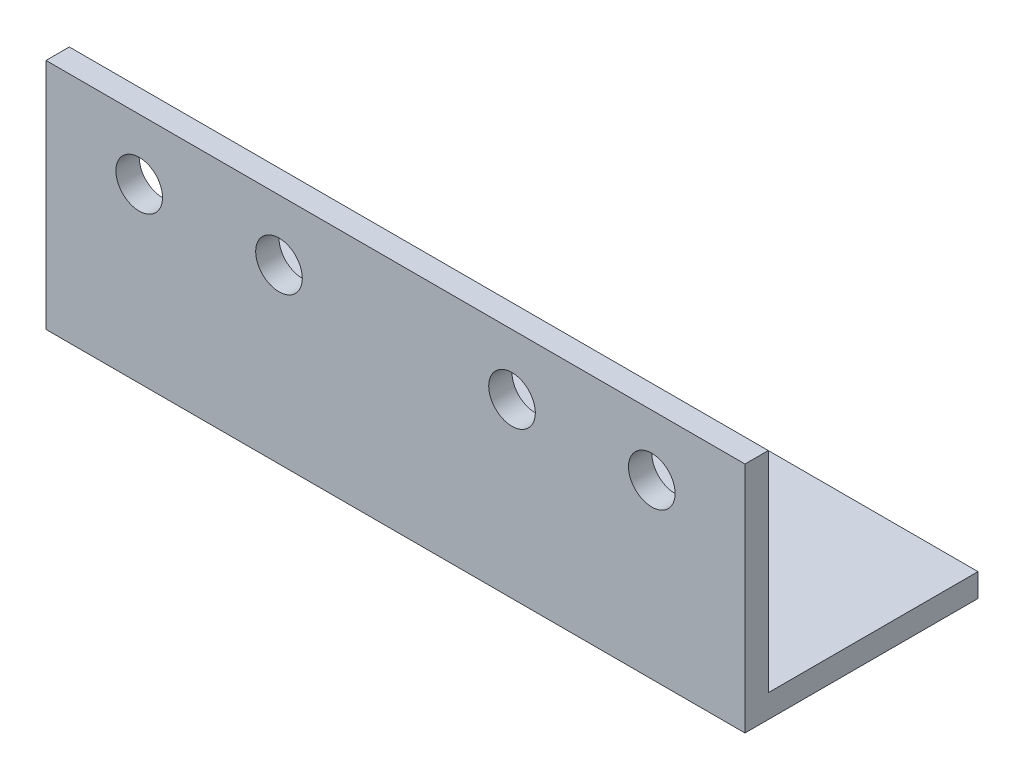
ISO-10303-21;
HEADER;
FILE_DESCRIPTION(('STEP AP214'),'2;1');
FILE_NAME('part.step','',(''),(''),'','','');
FILE_SCHEMA(('AUTOMOTIVE_DESIGN { 1 0 10303 214 1 1 1 1 }'));
ENDSEC;
DATA;
#1=APPLICATION_CONTEXT('core data for automotive mechanical design processes');
#2=APPLICATION_PROTOCOL_DEFINITION('international standard','automotive_design',2000,#1);
#3=PRODUCT_CONTEXT('',#1,'mechanical');
#4=PRODUCT('Part','Part','',(#3));
#5=PRODUCT_RELATED_PRODUCT_CATEGORY('part','',(#4));
#6=PRODUCT_DEFINITION_FORMATION('','',#4);
#7=PRODUCT_DEFINITION_CONTEXT('part definition',#1,'design');
#8=PRODUCT_DEFINITION('design','',#6,#7);
#9=PRODUCT_DEFINITION_SHAPE('','',#8);
#10=(LENGTH_UNIT() NAMED_UNIT(*) SI_UNIT(.MILLI.,.METRE.));
#11=(NAMED_UNIT(*) PLANE_ANGLE_UNIT() SI_UNIT($,.RADIAN.));
#12=(NAMED_UNIT(*) SI_UNIT($,.STERADIAN.) SOLID_ANGLE_UNIT());
#13=UNCERTAINTY_MEASURE_WITH_UNIT(LENGTH_MEASURE(1.E-05),#10,'distance_accuracy_value','');
#14=(GEOMETRIC_REPRESENTATION_CONTEXT(3) GLOBAL_UNCERTAINTY_ASSIGNED_CONTEXT((#13)) GLOBAL_UNIT_ASSIGNED_CONTEXT((#10,
#11,#12)) REPRESENTATION_CONTEXT('',''));
#15=CARTESIAN_POINT('',(0.,0.,0.));
#16=DIRECTION('',(0.,0.,1.));
#17=DIRECTION('',(1.,0.,0.));
#18=AXIS2_PLACEMENT_3D('',#15,#16,#17);
#19=CARTESIAN_POINT('',(150.,0.,0.));
#20=DIRECTION('',(0.,1.,0.));
#21=DIRECTION('',(0.,0.,1.));
#22=AXIS2_PLACEMENT_3D('',#19,#20,#21);
#23=PLANE('',#22);
#24=CARTESIAN_POINT('',(100.,0.,-18.));
#25=DIRECTION('',(0.,-1.,0.));
#26=DIRECTION('',(0.,0.,-1.));
#27=AXIS2_PLACEMENT_3D('',#24,#25,#26);
#28=CIRCLE('',#27,4.99999999999999);
#29=CARTESIAN_POINT('',(100.,0.,-23.));
#30=VERTEX_POINT('',#29);
#31=EDGE_CURVE('E155',#30,#30,#28,.T.);
#32=ORIENTED_EDGE('',*,*,#31,.F.);
#33=EDGE_LOOP('',(#32));
#34=FACE_BOUND('',#33,.T.);
#35=CARTESIAN_POINT('',(19.9999999999995,0.,-17.9999999999998));
#36=DIRECTION('',(0.,-1.,0.));
#37=DIRECTION('',(0.,0.,1.));
#38=AXIS2_PLACEMENT_3D('',#35,#36,#37);
#39=CIRCLE('',#38,4.99999999999999);
#40=CARTESIAN_POINT('',(19.9999999999995,0.,-12.9999999999998));
#41=VERTEX_POINT('',#40);
#42=EDGE_CURVE('E145',#41,#41,#39,.T.);
#43=ORIENTED_EDGE('',*,*,#42,.F.);
#44=EDGE_LOOP('',(#43));
#45=FACE_BOUND('',#44,.T.);
#46=CARTESIAN_POINT('',(49.9999999999995,0.,-18.));
#47=DIRECTION('',(0.,-1.,0.));
#48=DIRECTION('',(0.,0.,1.));
#49=AXIS2_PLACEMENT_3D('',#46,#47,#48);
#50=CIRCLE('',#49,4.99999999999999);
#51=CARTESIAN_POINT('',(49.9999999999995,0.,-13.));
#52=VERTEX_POINT('',#51);
#53=EDGE_CURVE('E142',#52,#52,#50,.T.);
#54=ORIENTED_EDGE('',*,*,#53,.F.);
#55=EDGE_LOOP('',(#54));
#56=FACE_BOUND('',#55,.T.);
#57=CARTESIAN_POINT('',(130.,0.,-17.9999999999998));
#58=DIRECTION('',(0.,-1.,0.));
#59=DIRECTION('',(0.,0.,-1.));
#60=AXIS2_PLACEMENT_3D('',#57,#58,#59);
#61=CIRCLE('',#60,4.99999999999999);
#62=CARTESIAN_POINT('',(130.,0.,-22.9999999999998));
#63=VERTEX_POINT('',#62);
#64=EDGE_CURVE('E139',#63,#63,#61,.T.);
#65=ORIENTED_EDGE('',*,*,#64,.F.);
#66=EDGE_LOOP('',(#65));
#67=FACE_BOUND('',#66,.T.);
#68=DIRECTION('',(0.,0.,-1.));
#69=VECTOR('',#68,1.);
#70=CARTESIAN_POINT('',(0.,0.,0.));
#71=LINE('',#70,#69);
#72=CARTESIAN_POINT('',(0.,0.,0.));
#73=VERTEX_POINT('',#72);
#74=CARTESIAN_POINT('',(0.,0.,-50.));
#75=VERTEX_POINT('',#74);
#76=EDGE_CURVE('E117',#73,#75,#71,.T.);
#77=ORIENTED_EDGE('',*,*,#76,.T.);
#78=DIRECTION('',(-1.,0.,0.));
#79=VECTOR('',#78,1.);
#80=CARTESIAN_POINT('',(150.,0.,-50.));
#81=LINE('',#80,#79);
#82=CARTESIAN_POINT('',(150.,0.,-50.));
#83=VERTEX_POINT('',#82);
#84=EDGE_CURVE('E11',#83,#75,#81,.T.);
#85=ORIENTED_EDGE('',*,*,#84,.F.);
#86=DIRECTION('',(0.,0.,-1.));
#87=VECTOR('',#86,1.);
#88=CARTESIAN_POINT('',(150.,0.,0.));
#89=LINE('',#88,#87);
#90=CARTESIAN_POINT('',(150.,0.,0.));
#91=VERTEX_POINT('',#90);
#92=EDGE_CURVE('E82',#91,#83,#89,.T.);
#93=ORIENTED_EDGE('',*,*,#92,.F.);
#94=DIRECTION('',(-1.,0.,0.));
#95=VECTOR('',#94,1.);
#96=CARTESIAN_POINT('',(150.,0.,0.));
#97=LINE('',#96,#95);
#98=EDGE_CURVE('E113',#91,#73,#97,.T.);
#99=ORIENTED_EDGE('',*,*,#98,.T.);
#100=EDGE_LOOP('',(#77,#85,#93,#99));
#101=FACE_BOUND('',#100,.T.);
#102=ADVANCED_FACE('F34',(#34,#45,#56,#67,#101),#23,.F.);
#103=CARTESIAN_POINT('',(150.,5.,-50.));
#104=DIRECTION('',(0.,0.,-1.));
#105=DIRECTION('',(-1.,0.,0.));
#106=AXIS2_PLACEMENT_3D('',#103,#104,#105);
#107=PLANE('',#106);
#108=DIRECTION('',(0.,-1.,0.));
#109=VECTOR('',#108,1.);
#110=CARTESIAN_POINT('',(0.,5.,-50.));
#111=LINE('',#110,#109);
#112=CARTESIAN_POINT('',(0.,5.,-50.));
#113=VERTEX_POINT('',#112);
#114=EDGE_CURVE('E120',#113,#75,#111,.T.);
#115=ORIENTED_EDGE('',*,*,#114,.F.);
#116=DIRECTION('',(-1.,0.,0.));
#117=VECTOR('',#116,1.);
#118=CARTESIAN_POINT('',(150.,5.,-50.));
#119=LINE('',#118,#117);
#120=CARTESIAN_POINT('',(150.,5.,-50.));
#121=VERTEX_POINT('',#120);
#122=EDGE_CURVE('E43',#121,#113,#119,.T.);
#123=ORIENTED_EDGE('',*,*,#122,.F.);
#124=DIRECTION('',(0.,-1.,0.));
#125=VECTOR('',#124,1.);
#126=CARTESIAN_POINT('',(150.,5.,-50.));
#127=LINE('',#126,#125);
#128=EDGE_CURVE('E183',#121,#83,#127,.T.);
#129=ORIENTED_EDGE('',*,*,#128,.T.);
#130=ORIENTED_EDGE('',*,*,#84,.T.);
#131=EDGE_LOOP('',(#115,#123,#129,#130));
#132=FACE_BOUND('',#131,.T.);
#133=ADVANCED_FACE('F207',(#132),#107,.T.);
#134=CARTESIAN_POINT('',(150.,5.,0.));
#135=DIRECTION('',(0.,1.,0.));
#136=DIRECTION('',(0.,0.,1.));
#137=AXIS2_PLACEMENT_3D('',#134,#135,#136);
#138=PLANE('',#137);
#139=CARTESIAN_POINT('',(100.,5.,-18.));
#140=DIRECTION('',(0.,1.,0.));
#141=DIRECTION('',(0.,0.,1.));
#142=AXIS2_PLACEMENT_3D('',#139,#140,#141);
#143=CIRCLE('',#142,4.99999999999999);
#144=CARTESIAN_POINT('',(100.,5.,-13.));
#145=VERTEX_POINT('',#144);
#146=EDGE_CURVE('E37',#145,#145,#143,.T.);
#147=ORIENTED_EDGE('',*,*,#146,.F.);
#148=EDGE_LOOP('',(#147));
#149=FACE_BOUND('',#148,.T.);
#150=CARTESIAN_POINT('',(19.9999999999995,5.,-17.9999999999998));
#151=DIRECTION('',(0.,1.,0.));
#152=DIRECTION('',(0.,0.,1.));
#153=AXIS2_PLACEMENT_3D('',#150,#151,#152);
#154=CIRCLE('',#153,4.99999999999999);
#155=CARTESIAN_POINT('',(19.9999999999995,5.,-12.9999999999998));
#156=VERTEX_POINT('',#155);
#157=EDGE_CURVE('E143',#156,#156,#154,.T.);
#158=ORIENTED_EDGE('',*,*,#157,.F.);
#159=EDGE_LOOP('',(#158));
#160=FACE_BOUND('',#159,.T.);
#161=CARTESIAN_POINT('',(49.9999999999995,5.,-18.));
#162=DIRECTION('',(0.,1.,0.));
#163=DIRECTION('',(0.,0.,1.));
#164=AXIS2_PLACEMENT_3D('',#161,#162,#163);
#165=CIRCLE('',#164,4.99999999999999);
#166=CARTESIAN_POINT('',(49.9999999999995,5.,-13.));
#167=VERTEX_POINT('',#166);
#168=EDGE_CURVE('E140',#167,#167,#165,.T.);
#169=ORIENTED_EDGE('',*,*,#168,.F.);
#170=EDGE_LOOP('',(#169));
#171=FACE_BOUND('',#170,.T.);
#172=CARTESIAN_POINT('',(130.,5.,-17.9999999999998));
#173=DIRECTION('',(0.,1.,0.));
#174=DIRECTION('',(0.,0.,1.));
#175=AXIS2_PLACEMENT_3D('',#172,#173,#174);
#176=CIRCLE('',#175,4.99999999999999);
#177=CARTESIAN_POINT('',(130.,5.,-12.9999999999998));
#178=VERTEX_POINT('',#177);
#179=EDGE_CURVE('E135',#178,#178,#176,.T.);
#180=ORIENTED_EDGE('',*,*,#179,.F.);
#181=EDGE_LOOP('',(#180));
#182=FACE_BOUND('',#181,.T.);
#183=DIRECTION('',(0.,0.,-1.));
#184=VECTOR('',#183,1.);
#185=CARTESIAN_POINT('',(0.,5.,0.));
#186=LINE('',#185,#184);
#187=CARTESIAN_POINT('',(0.,5.,-5.));
#188=VERTEX_POINT('',#187);
#189=EDGE_CURVE('E124',#188,#113,#186,.T.);
#190=ORIENTED_EDGE('',*,*,#189,.F.);
#191=DIRECTION('',(-1.,0.,0.));
#192=VECTOR('',#191,1.);
#193=CARTESIAN_POINT('',(150.,5.,-5.));
#194=LINE('',#193,#192);
#195=CARTESIAN_POINT('',(150.,5.,-5.));
#196=VERTEX_POINT('',#195);
#197=EDGE_CURVE('E103',#196,#188,#194,.T.);
#198=ORIENTED_EDGE('',*,*,#197,.F.);
#199=DIRECTION('',(0.,0.,-1.));
#200=VECTOR('',#199,1.);
#201=CARTESIAN_POINT('',(150.,5.,0.));
#202=LINE('',#201,#200);
#203=EDGE_CURVE('E109',#196,#121,#202,.T.);
#204=ORIENTED_EDGE('',*,*,#203,.T.);
#205=ORIENTED_EDGE('',*,*,#122,.T.);
#206=EDGE_LOOP('',(#190,#198,#204,#205));
#207=FACE_BOUND('',#206,.T.);
#208=ADVANCED_FACE('F187',(#149,#160,#171,#182,#207),#138,.T.);
#209=CARTESIAN_POINT('',(150.,0.,-5.));
#210=DIRECTION('',(0.,0.,-1.));
#211=DIRECTION('',(-1.,0.,0.));
#212=AXIS2_PLACEMENT_3D('',#209,#210,#211);
#213=PLANE('',#212);
#214=CARTESIAN_POINT('',(130.,37.,-5.));
#215=DIRECTION('',(0.,0.,-1.));
#216=DIRECTION('',(-1.,0.,0.));
#217=AXIS2_PLACEMENT_3D('',#214,#215,#216);
#218=CIRCLE('',#217,4.99999999999999);
#219=CARTESIAN_POINT('',(125.,37.,-5.));
#220=VERTEX_POINT('',#219);
#221=EDGE_CURVE('E162',#220,#220,#218,.T.);
#222=ORIENTED_EDGE('',*,*,#221,.F.);
#223=EDGE_LOOP('',(#222));
#224=FACE_BOUND('',#223,.T.);
#225=CARTESIAN_POINT('',(100.,37.,-5.));
#226=DIRECTION('',(0.,0.,-1.));
#227=DIRECTION('',(-1.,0.,0.));
#228=AXIS2_PLACEMENT_3D('',#225,#226,#227);
#229=CIRCLE('',#228,4.99999999999999);
#230=CARTESIAN_POINT('',(95.0000000000001,37.,-5.));
#231=VERTEX_POINT('',#230);
#232=EDGE_CURVE('E168',#231,#231,#229,.T.);
#233=ORIENTED_EDGE('',*,*,#232,.F.);
#234=EDGE_LOOP('',(#233));
#235=FACE_BOUND('',#234,.T.);
#236=CARTESIAN_POINT('',(49.9999999999999,37.,-5.));
#237=DIRECTION('',(0.,0.,-1.));
#238=DIRECTION('',(-1.,0.,0.));
#239=AXIS2_PLACEMENT_3D('',#236,#237,#238);
#240=CIRCLE('',#239,4.99999999999999);
#241=CARTESIAN_POINT('',(44.9999999999999,37.,-5.));
#242=VERTEX_POINT('',#241);
#243=EDGE_CURVE('E174',#242,#242,#240,.T.);
#244=ORIENTED_EDGE('',*,*,#243,.F.);
#245=EDGE_LOOP('',(#244));
#246=FACE_BOUND('',#245,.T.);
#247=CARTESIAN_POINT('',(19.9999999999999,37.,-5.));
#248=DIRECTION('',(0.,0.,-1.));
#249=DIRECTION('',(-1.,0.,0.));
#250=AXIS2_PLACEMENT_3D('',#247,#248,#249);
#251=CIRCLE('',#250,4.99999999999999);
#252=CARTESIAN_POINT('',(14.9999999999999,37.,-5.));
#253=VERTEX_POINT('',#252);
#254=EDGE_CURVE('E121',#253,#253,#251,.T.);
#255=ORIENTED_EDGE('',*,*,#254,.F.);
#256=EDGE_LOOP('',(#255));
#257=FACE_BOUND('',#256,.T.);
#258=DIRECTION('',(0.,1.,0.));
#259=VECTOR('',#258,1.);
#260=CARTESIAN_POINT('',(0.,0.,-5.));
#261=LINE('',#260,#259);
#262=CARTESIAN_POINT('',(0.,50.,-5.));
#263=VERTEX_POINT('',#262);
#264=EDGE_CURVE('E98',#263,#188,#261,.F.);
#265=ORIENTED_EDGE('',*,*,#264,.F.);
#266=DIRECTION('',(-1.,0.,0.));
#267=VECTOR('',#266,1.);
#268=CARTESIAN_POINT('',(150.,50.,-5.));
#269=LINE('',#268,#267);
#270=CARTESIAN_POINT('',(150.,50.,-5.));
#271=VERTEX_POINT('',#270);
#272=EDGE_CURVE('E93',#271,#263,#269,.T.);
#273=ORIENTED_EDGE('',*,*,#272,.F.);
#274=DIRECTION('',(0.,1.,0.));
#275=VECTOR('',#274,1.);
#276=CARTESIAN_POINT('',(150.,0.,-5.));
#277=LINE('',#276,#275);
#278=EDGE_CURVE('E96',#271,#196,#277,.F.);
#279=ORIENTED_EDGE('',*,*,#278,.T.);
#280=ORIENTED_EDGE('',*,*,#197,.T.);
#281=EDGE_LOOP('',(#265,#273,#279,#280));
#282=FACE_BOUND('',#281,.T.);
#283=ADVANCED_FACE('F95',(#224,#235,#246,#257,#282),#213,.T.);
#284=CARTESIAN_POINT('',(150.,50.,0.));
#285=DIRECTION('',(0.,1.,0.));
#286=DIRECTION('',(0.,0.,1.));
#287=AXIS2_PLACEMENT_3D('',#284,#285,#286);
#288=PLANE('',#287);
#289=DIRECTION('',(0.,0.,-1.));
#290=VECTOR('',#289,1.);
#291=CARTESIAN_POINT('',(0.,50.,0.));
#292=LINE('',#291,#290);
#293=CARTESIAN_POINT('',(0.,50.,0.));
#294=VERTEX_POINT('',#293);
#295=EDGE_CURVE('E128',#294,#263,#292,.T.);
#296=ORIENTED_EDGE('',*,*,#295,.F.);
#297=DIRECTION('',(-1.,0.,0.));
#298=VECTOR('',#297,1.);
#299=CARTESIAN_POINT('',(150.,50.,0.));
#300=LINE('',#299,#298);
#301=CARTESIAN_POINT('',(150.,50.,0.));
#302=VERTEX_POINT('',#301);
#303=EDGE_CURVE('E73',#302,#294,#300,.T.);
#304=ORIENTED_EDGE('',*,*,#303,.F.);
#305=DIRECTION('',(0.,0.,-1.));
#306=VECTOR('',#305,1.);
#307=CARTESIAN_POINT('',(150.,50.,0.));
#308=LINE('',#307,#306);
#309=EDGE_CURVE('E107',#302,#271,#308,.T.);
#310=ORIENTED_EDGE('',*,*,#309,.T.);
#311=ORIENTED_EDGE('',*,*,#272,.T.);
#312=EDGE_LOOP('',(#296,#304,#310,#311));
#313=FACE_BOUND('',#312,.T.);
#314=ADVANCED_FACE('F111',(#313),#288,.T.);
#315=CARTESIAN_POINT('',(150.,0.,0.));
#316=DIRECTION('',(0.,0.,-1.));
#317=DIRECTION('',(-1.,0.,0.));
#318=AXIS2_PLACEMENT_3D('',#315,#316,#317);
#319=PLANE('',#318);
#320=CARTESIAN_POINT('',(130.,37.,0.));
#321=DIRECTION('',(0.,0.,1.));
#322=DIRECTION('',(-1.,0.,0.));
#323=AXIS2_PLACEMENT_3D('',#320,#321,#322);
#324=CIRCLE('',#323,4.99999999999999);
#325=CARTESIAN_POINT('',(125.,37.,0.));
#326=VERTEX_POINT('',#325);
#327=EDGE_CURVE('E138',#326,#326,#324,.T.);
#328=ORIENTED_EDGE('',*,*,#327,.F.);
#329=EDGE_LOOP('',(#328));
#330=FACE_BOUND('',#329,.T.);
#331=CARTESIAN_POINT('',(100.,37.,0.));
#332=DIRECTION('',(0.,0.,1.));
#333=DIRECTION('',(-1.,0.,0.));
#334=AXIS2_PLACEMENT_3D('',#331,#332,#333);
#335=CIRCLE('',#334,4.99999999999999);
#336=CARTESIAN_POINT('',(95.0000000000001,37.,0.));
#337=VERTEX_POINT('',#336);
#338=EDGE_CURVE('E165',#337,#337,#335,.T.);
#339=ORIENTED_EDGE('',*,*,#338,.F.);
#340=EDGE_LOOP('',(#339));
#341=FACE_BOUND('',#340,.T.);
#342=CARTESIAN_POINT('',(49.9999999999999,37.,0.));
#343=DIRECTION('',(0.,0.,1.));
#344=DIRECTION('',(1.,0.,0.));
#345=AXIS2_PLACEMENT_3D('',#342,#343,#344);
#346=CIRCLE('',#345,4.99999999999999);
#347=CARTESIAN_POINT('',(54.9999999999999,37.,0.));
#348=VERTEX_POINT('',#347);
#349=EDGE_CURVE('E171',#348,#348,#346,.T.);
#350=ORIENTED_EDGE('',*,*,#349,.F.);
#351=EDGE_LOOP('',(#350));
#352=FACE_BOUND('',#351,.T.);
#353=CARTESIAN_POINT('',(19.9999999999999,37.,0.));
#354=DIRECTION('',(0.,0.,1.));
#355=DIRECTION('',(1.,0.,0.));
#356=AXIS2_PLACEMENT_3D('',#353,#354,#355);
#357=CIRCLE('',#356,4.99999999999999);
#358=CARTESIAN_POINT('',(24.9999999999999,37.,0.));
#359=VERTEX_POINT('',#358);
#360=EDGE_CURVE('E177',#359,#359,#357,.T.);
#361=ORIENTED_EDGE('',*,*,#360,.F.);
#362=EDGE_LOOP('',(#361));
#363=FACE_BOUND('',#362,.T.);
#364=DIRECTION('',(0.,-1.,0.));
#365=VECTOR('',#364,1.);
#366=CARTESIAN_POINT('',(0.,0.,0.));
#367=LINE('',#366,#365);
#368=EDGE_CURVE('E76',#294,#73,#367,.T.);
#369=ORIENTED_EDGE('',*,*,#368,.T.);
#370=ORIENTED_EDGE('',*,*,#98,.F.);
#371=DIRECTION('',(0.,-1.,0.));
#372=VECTOR('',#371,1.);
#373=CARTESIAN_POINT('',(150.,0.,0.));
#374=LINE('',#373,#372);
#375=EDGE_CURVE('E52',#302,#91,#374,.T.);
#376=ORIENTED_EDGE('',*,*,#375,.F.);
#377=ORIENTED_EDGE('',*,*,#303,.T.);
#378=EDGE_LOOP('',(#369,#370,#376,#377));
#379=FACE_BOUND('',#378,.T.);
#380=ADVANCED_FACE('F193',(#330,#341,#352,#363,#379),#319,.F.);
#381=CARTESIAN_POINT('',(150.,0.,0.));
#382=DIRECTION('',(-1.,0.,0.));
#383=DIRECTION('',(0.,0.,1.));
#384=AXIS2_PLACEMENT_3D('',#381,#382,#383);
#385=PLANE('',#384);
#386=ORIENTED_EDGE('',*,*,#92,.T.);
#387=ORIENTED_EDGE('',*,*,#128,.F.);
#388=ORIENTED_EDGE('',*,*,#203,.F.);
#389=ORIENTED_EDGE('',*,*,#278,.F.);
#390=ORIENTED_EDGE('',*,*,#309,.F.);
#391=ORIENTED_EDGE('',*,*,#375,.T.);
#392=EDGE_LOOP('',(#386,#387,#388,#389,#390,#391));
#393=FACE_BOUND('',#392,.T.);
#394=ADVANCED_FACE('F106',(#393),#385,.F.);
#395=CARTESIAN_POINT('',(0.,0.,0.));
#396=DIRECTION('',(-1.,0.,0.));
#397=DIRECTION('',(0.,0.,1.));
#398=AXIS2_PLACEMENT_3D('',#395,#396,#397);
#399=PLANE('',#398);
#400=ORIENTED_EDGE('',*,*,#76,.F.);
#401=ORIENTED_EDGE('',*,*,#368,.F.);
#402=ORIENTED_EDGE('',*,*,#295,.T.);
#403=ORIENTED_EDGE('',*,*,#264,.T.);
#404=ORIENTED_EDGE('',*,*,#189,.T.);
#405=ORIENTED_EDGE('',*,*,#114,.T.);
#406=EDGE_LOOP('',(#400,#401,#402,#403,#404,#405));
#407=FACE_BOUND('',#406,.T.);
#408=ADVANCED_FACE('F191',(#407),#399,.T.);
#409=CARTESIAN_POINT('',(19.9999999999999,37.,-50.));
#410=DIRECTION('',(0.,0.,1.));
#411=DIRECTION('',(1.,0.,0.));
#412=AXIS2_PLACEMENT_3D('',#409,#410,#411);
#413=CYLINDRICAL_SURFACE('',#412,4.99999999999999);
#414=ORIENTED_EDGE('',*,*,#254,.T.);
#415=EDGE_LOOP('',(#414));
#416=FACE_BOUND('',#415,.T.);
#417=ORIENTED_EDGE('',*,*,#360,.T.);
#418=EDGE_LOOP('',(#417));
#419=FACE_BOUND('',#418,.T.);
#420=ADVANCED_FACE('F245',(#416,#419),#413,.F.);
#421=CARTESIAN_POINT('',(49.9999999999999,37.,-50.));
#422=DIRECTION('',(0.,0.,1.));
#423=DIRECTION('',(1.,0.,0.));
#424=AXIS2_PLACEMENT_3D('',#421,#422,#423);
#425=CYLINDRICAL_SURFACE('',#424,4.99999999999999);
#426=ORIENTED_EDGE('',*,*,#243,.T.);
#427=EDGE_LOOP('',(#426));
#428=FACE_BOUND('',#427,.T.);
#429=ORIENTED_EDGE('',*,*,#349,.T.);
#430=EDGE_LOOP('',(#429));
#431=FACE_BOUND('',#430,.T.);
#432=ADVANCED_FACE('F241',(#428,#431),#425,.F.);
#433=CARTESIAN_POINT('',(100.,37.,-50.));
#434=DIRECTION('',(0.,0.,1.));
#435=DIRECTION('',(1.,0.,0.));
#436=AXIS2_PLACEMENT_3D('',#433,#434,#435);
#437=CYLINDRICAL_SURFACE('',#436,4.99999999999999);
#438=ORIENTED_EDGE('',*,*,#232,.T.);
#439=EDGE_LOOP('',(#438));
#440=FACE_BOUND('',#439,.T.);
#441=ORIENTED_EDGE('',*,*,#338,.T.);
#442=EDGE_LOOP('',(#441));
#443=FACE_BOUND('',#442,.T.);
#444=ADVANCED_FACE('F234',(#440,#443),#437,.F.);
#445=CARTESIAN_POINT('',(130.,37.,-50.));
#446=DIRECTION('',(0.,0.,1.));
#447=DIRECTION('',(1.,0.,0.));
#448=AXIS2_PLACEMENT_3D('',#445,#446,#447);
#449=CYLINDRICAL_SURFACE('',#448,4.99999999999999);
#450=ORIENTED_EDGE('',*,*,#221,.T.);
#451=EDGE_LOOP('',(#450));
#452=FACE_BOUND('',#451,.T.);
#453=ORIENTED_EDGE('',*,*,#327,.T.);
#454=EDGE_LOOP('',(#453));
#455=FACE_BOUND('',#454,.T.);
#456=ADVANCED_FACE('F224',(#452,#455),#449,.F.);
#457=CARTESIAN_POINT('',(130.,50.,-17.9999999999998));
#458=DIRECTION('',(0.,-1.,0.));
#459=DIRECTION('',(0.,0.,-1.));
#460=AXIS2_PLACEMENT_3D('',#457,#458,#459);
#461=CYLINDRICAL_SURFACE('',#460,4.99999999999999);
#462=ORIENTED_EDGE('',*,*,#179,.T.);
#463=EDGE_LOOP('',(#462));
#464=FACE_BOUND('',#463,.T.);
#465=ORIENTED_EDGE('',*,*,#64,.T.);
#466=EDGE_LOOP('',(#465));
#467=FACE_BOUND('',#466,.T.);
#468=ADVANCED_FACE('F221',(#464,#467),#461,.F.);
#469=CARTESIAN_POINT('',(49.9999999999995,50.,-18.));
#470=DIRECTION('',(0.,-1.,0.));
#471=DIRECTION('',(0.,0.,-1.));
#472=AXIS2_PLACEMENT_3D('',#469,#470,#471);
#473=CYLINDRICAL_SURFACE('',#472,4.99999999999999);
#474=ORIENTED_EDGE('',*,*,#168,.T.);
#475=EDGE_LOOP('',(#474));
#476=FACE_BOUND('',#475,.T.);
#477=ORIENTED_EDGE('',*,*,#53,.T.);
#478=EDGE_LOOP('',(#477));
#479=FACE_BOUND('',#478,.T.);
#480=ADVANCED_FACE('F223',(#476,#479),#473,.F.);
#481=CARTESIAN_POINT('',(19.9999999999995,50.,-17.9999999999998));
#482=DIRECTION('',(0.,-1.,0.));
#483=DIRECTION('',(0.,0.,-1.));
#484=AXIS2_PLACEMENT_3D('',#481,#482,#483);
#485=CYLINDRICAL_SURFACE('',#484,4.99999999999999);
#486=ORIENTED_EDGE('',*,*,#157,.T.);
#487=EDGE_LOOP('',(#486));
#488=FACE_BOUND('',#487,.T.);
#489=ORIENTED_EDGE('',*,*,#42,.T.);
#490=EDGE_LOOP('',(#489));
#491=FACE_BOUND('',#490,.T.);
#492=ADVANCED_FACE('F231',(#488,#491),#485,.F.);
#493=CARTESIAN_POINT('',(100.,50.,-18.));
#494=DIRECTION('',(0.,-1.,0.));
#495=DIRECTION('',(0.,0.,-1.));
#496=AXIS2_PLACEMENT_3D('',#493,#494,#495);
#497=CYLINDRICAL_SURFACE('',#496,4.99999999999999);
#498=ORIENTED_EDGE('',*,*,#146,.T.);
#499=EDGE_LOOP('',(#498));
#500=FACE_BOUND('',#499,.T.);
#501=ORIENTED_EDGE('',*,*,#31,.T.);
#502=EDGE_LOOP('',(#501));
#503=FACE_BOUND('',#502,.T.);
#504=ADVANCED_FACE('F306',(#500,#503),#497,.F.);
#505=CLOSED_SHELL('',(#102,#133,#208,#283,#314,#380,#394,#408,#420,#432,#444,#456,#468,#480,
#492,#504));
#506=MANIFOLD_SOLID_BREP('B2',#505);
#507=ADVANCED_BREP_SHAPE_REPRESENTATION('',(#18,#506),#14);
#508=SHAPE_DEFINITION_REPRESENTATION(#9,#507);
ENDSEC;
END-ISO-10303-21;
